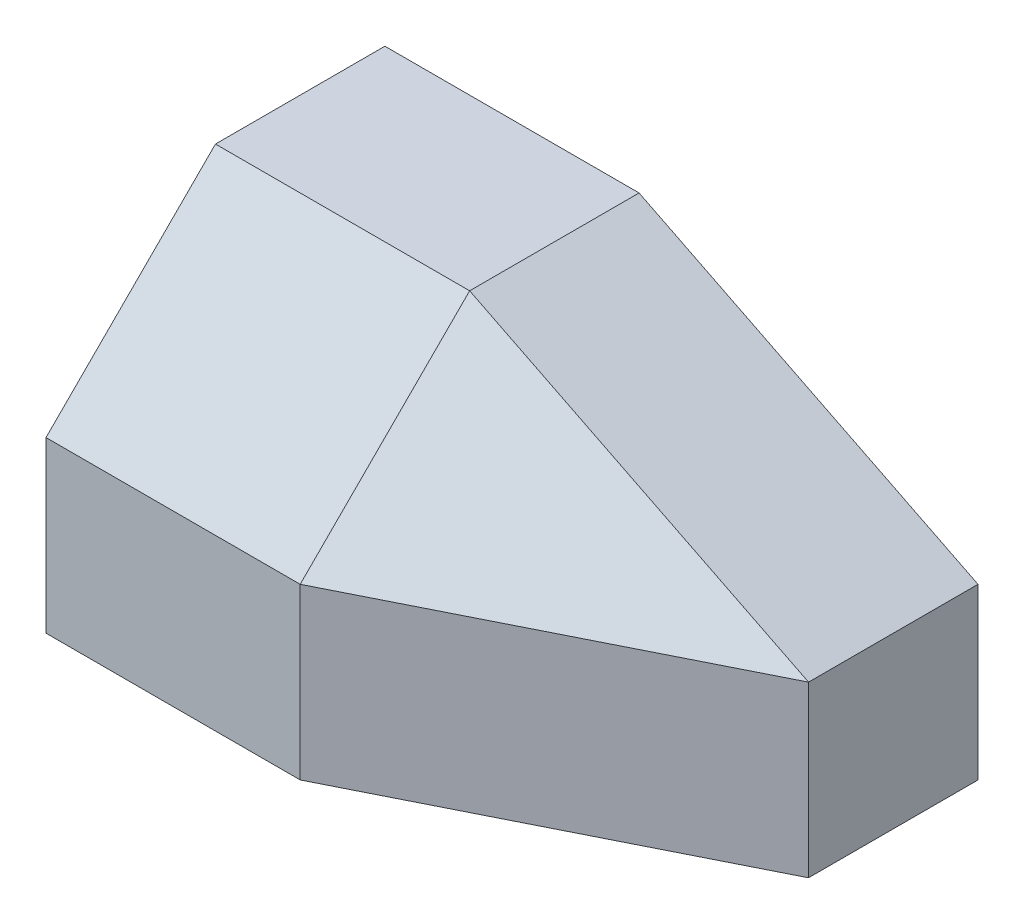
ISO-10303-21;
HEADER;
FILE_DESCRIPTION(('STEP AP214'),'2;1');
FILE_NAME('part.step','',(''),(''),'','','');
FILE_SCHEMA(('AUTOMOTIVE_DESIGN { 1 0 10303 214 1 1 1 1 }'));
ENDSEC;
DATA;
#1=APPLICATION_CONTEXT('core data for automotive mechanical design processes');
#2=APPLICATION_PROTOCOL_DEFINITION('international standard','automotive_design',2000,#1);
#3=PRODUCT_CONTEXT('',#1,'mechanical');
#4=PRODUCT('Part','Part','',(#3));
#5=PRODUCT_RELATED_PRODUCT_CATEGORY('part','',(#4));
#6=PRODUCT_DEFINITION_FORMATION('','',#4);
#7=PRODUCT_DEFINITION_CONTEXT('part definition',#1,'design');
#8=PRODUCT_DEFINITION('design','',#6,#7);
#9=PRODUCT_DEFINITION_SHAPE('','',#8);
#10=(LENGTH_UNIT() NAMED_UNIT(*) SI_UNIT(.MILLI.,.METRE.));
#11=(NAMED_UNIT(*) PLANE_ANGLE_UNIT() SI_UNIT($,.RADIAN.));
#12=(NAMED_UNIT(*) SI_UNIT($,.STERADIAN.) SOLID_ANGLE_UNIT());
#13=UNCERTAINTY_MEASURE_WITH_UNIT(LENGTH_MEASURE(1.E-05),#10,'distance_accuracy_value','');
#14=(GEOMETRIC_REPRESENTATION_CONTEXT(3) GLOBAL_UNCERTAINTY_ASSIGNED_CONTEXT((#13)) GLOBAL_UNIT_ASSIGNED_CONTEXT((#10,
#11,#12)) REPRESENTATION_CONTEXT('',''));
#15=CARTESIAN_POINT('',(0.,0.,0.));
#16=DIRECTION('',(0.,0.,1.));
#17=DIRECTION('',(1.,0.,0.));
#18=AXIS2_PLACEMENT_3D('',#15,#16,#17);
#19=CARTESIAN_POINT('',(762.,1016.,0.));
#20=DIRECTION('',(0.,0.,-1.));
#21=DIRECTION('',(-1.,0.,0.));
#22=AXIS2_PLACEMENT_3D('',#19,#20,#21);
#23=PLANE('',#22);
#24=DIRECTION('',(0.,-1.,0.));
#25=VECTOR('',#24,1.);
#26=CARTESIAN_POINT('',(762.,1016.,0.));
#27=LINE('',#26,#25);
#28=CARTESIAN_POINT('',(761.999999999999,508.,-1.11022302462516E-13));
#29=VERTEX_POINT('',#28);
#30=CARTESIAN_POINT('',(762.,0.,0.));
#31=VERTEX_POINT('',#30);
#32=EDGE_CURVE('E41',#29,#31,#27,.T.);
#33=ORIENTED_EDGE('',*,*,#32,.F.);
#34=DIRECTION('',(-1.,0.,0.));
#35=VECTOR('',#34,1.);
#36=CARTESIAN_POINT('',(1778.,508.,0.));
#37=LINE('',#36,#35);
#38=CARTESIAN_POINT('',(0.,508.,0.));
#39=VERTEX_POINT('',#38);
#40=EDGE_CURVE('E150',#29,#39,#37,.T.);
#41=ORIENTED_EDGE('',*,*,#40,.T.);
#42=DIRECTION('',(0.,-1.,0.));
#43=VECTOR('',#42,1.);
#44=CARTESIAN_POINT('',(0.,1016.,0.));
#45=LINE('',#44,#43);
#46=CARTESIAN_POINT('',(0.,0.,0.));
#47=VERTEX_POINT('',#46);
#48=EDGE_CURVE('E96',#39,#47,#45,.T.);
#49=ORIENTED_EDGE('',*,*,#48,.T.);
#50=DIRECTION('',(1.,0.,0.));
#51=VECTOR('',#50,1.);
#52=CARTESIAN_POINT('',(762.,0.,0.));
#53=LINE('',#52,#51);
#54=EDGE_CURVE('E101',#47,#31,#53,.T.);
#55=ORIENTED_EDGE('',*,*,#54,.T.);
#56=EDGE_LOOP('',(#33,#41,#49,#55));
#57=FACE_BOUND('',#56,.T.);
#58=ADVANCED_FACE('F34',(#57),#23,.F.);
#59=CARTESIAN_POINT('',(1778.,1016.,-508.));
#60=DIRECTION('',(-0.447213595499958,0.,-0.894427190999916));
#61=DIRECTION('',(-0.894427190999916,0.,0.447213595499958));
#62=AXIS2_PLACEMENT_3D('',#59,#60,#61);
#63=PLANE('',#62);
#64=DIRECTION('',(0.,-1.,0.));
#65=VECTOR('',#64,1.);
#66=CARTESIAN_POINT('',(1778.,1016.,-508.));
#67=LINE('',#66,#65);
#68=CARTESIAN_POINT('',(1778.,508.,-508.000000000001));
#69=VERTEX_POINT('',#68);
#70=CARTESIAN_POINT('',(1778.,0.,-508.));
#71=VERTEX_POINT('',#70);
#72=EDGE_CURVE('E108',#69,#71,#67,.T.);
#73=ORIENTED_EDGE('',*,*,#72,.F.);
#74=DIRECTION('',(-0.894427190999916,0.,0.447213595499958));
#75=VECTOR('',#74,1.);
#76=CARTESIAN_POINT('',(1778.,507.999999999999,-508.));
#77=LINE('',#76,#75);
#78=EDGE_CURVE('E118',#69,#29,#77,.T.);
#79=ORIENTED_EDGE('',*,*,#78,.T.);
#80=ORIENTED_EDGE('',*,*,#32,.T.);
#81=DIRECTION('',(0.894427190999916,0.,-0.447213595499958));
#82=VECTOR('',#81,1.);
#83=CARTESIAN_POINT('',(1778.,0.,-508.));
#84=LINE('',#83,#82);
#85=EDGE_CURVE('E115',#31,#71,#84,.T.);
#86=ORIENTED_EDGE('',*,*,#85,.T.);
#87=EDGE_LOOP('',(#73,#79,#80,#86));
#88=FACE_BOUND('',#87,.T.);
#89=ADVANCED_FACE('F114',(#88),#63,.F.);
#90=CARTESIAN_POINT('',(1778.,1016.,-1016.));
#91=DIRECTION('',(-1.,0.,0.));
#92=DIRECTION('',(0.,0.,1.));
#93=AXIS2_PLACEMENT_3D('',#90,#91,#92);
#94=PLANE('',#93);
#95=DIRECTION('',(0.,-1.,0.));
#96=VECTOR('',#95,1.);
#97=CARTESIAN_POINT('',(1778.,1016.,-1016.));
#98=LINE('',#97,#96);
#99=CARTESIAN_POINT('',(1778.,508.,-1016.));
#100=VERTEX_POINT('',#99);
#101=CARTESIAN_POINT('',(1778.,0.,-1016.));
#102=VERTEX_POINT('',#101);
#103=EDGE_CURVE('E81',#100,#102,#98,.T.);
#104=ORIENTED_EDGE('',*,*,#103,.F.);
#105=DIRECTION('',(0.,0.,-1.));
#106=VECTOR('',#105,1.);
#107=CARTESIAN_POINT('',(1778.,508.,0.));
#108=LINE('',#107,#106);
#109=EDGE_CURVE('E124',#69,#100,#108,.T.);
#110=ORIENTED_EDGE('',*,*,#109,.F.);
#111=ORIENTED_EDGE('',*,*,#72,.T.);
#112=DIRECTION('',(0.,0.,-1.));
#113=VECTOR('',#112,1.);
#114=CARTESIAN_POINT('',(1778.,0.,-1016.));
#115=LINE('',#114,#113);
#116=EDGE_CURVE('E87',#71,#102,#115,.T.);
#117=ORIENTED_EDGE('',*,*,#116,.T.);
#118=EDGE_LOOP('',(#104,#110,#111,#117));
#119=FACE_BOUND('',#118,.T.);
#120=ADVANCED_FACE('F128',(#119),#94,.F.);
#121=CARTESIAN_POINT('',(0.,1016.,-1016.));
#122=DIRECTION('',(0.,0.,1.));
#123=DIRECTION('',(1.,0.,0.));
#124=AXIS2_PLACEMENT_3D('',#121,#122,#123);
#125=PLANE('',#124);
#126=DIRECTION('',(-1.,0.,0.));
#127=VECTOR('',#126,1.);
#128=CARTESIAN_POINT('',(0.,1016.,-1016.));
#129=LINE('',#128,#127);
#130=CARTESIAN_POINT('',(762.,1016.,-1016.));
#131=VERTEX_POINT('',#130);
#132=CARTESIAN_POINT('',(0.,1016.,-1016.));
#133=VERTEX_POINT('',#132);
#134=EDGE_CURVE('E54',#131,#133,#129,.T.);
#135=ORIENTED_EDGE('',*,*,#134,.F.);
#136=DIRECTION('',(-0.894427190999916,0.447213595499958,0.));
#137=VECTOR('',#136,1.);
#138=CARTESIAN_POINT('',(762.,1016.,-1016.));
#139=LINE('',#138,#137);
#140=EDGE_CURVE('E148',#100,#131,#139,.T.);
#141=ORIENTED_EDGE('',*,*,#140,.F.);
#142=ORIENTED_EDGE('',*,*,#103,.T.);
#143=DIRECTION('',(-1.,0.,0.));
#144=VECTOR('',#143,1.);
#145=CARTESIAN_POINT('',(0.,0.,-1016.));
#146=LINE('',#145,#144);
#147=CARTESIAN_POINT('',(0.,0.,-1016.));
#148=VERTEX_POINT('',#147);
#149=EDGE_CURVE('E74',#102,#148,#146,.T.);
#150=ORIENTED_EDGE('',*,*,#149,.T.);
#151=DIRECTION('',(0.,-1.,0.));
#152=VECTOR('',#151,1.);
#153=CARTESIAN_POINT('',(0.,1016.,-1016.));
#154=LINE('',#153,#152);
#155=EDGE_CURVE('E77',#133,#148,#154,.T.);
#156=ORIENTED_EDGE('',*,*,#155,.F.);
#157=EDGE_LOOP('',(#135,#141,#142,#150,#156));
#158=FACE_BOUND('',#157,.T.);
#159=ADVANCED_FACE('F76',(#158),#125,.F.);
#160=CARTESIAN_POINT('',(0.,1016.,0.));
#161=DIRECTION('',(1.,0.,0.));
#162=DIRECTION('',(0.,0.,-1.));
#163=AXIS2_PLACEMENT_3D('',#160,#161,#162);
#164=PLANE('',#163);
#165=ORIENTED_EDGE('',*,*,#48,.F.);
#166=DIRECTION('',(0.,-0.707106781186546,0.707106781186549));
#167=VECTOR('',#166,1.);
#168=CARTESIAN_POINT('',(0.,1016.,-508.000000000002));
#169=LINE('',#168,#167);
#170=CARTESIAN_POINT('',(0.,1016.,-508.000000000002));
#171=VERTEX_POINT('',#170);
#172=EDGE_CURVE('E155',#171,#39,#169,.T.);
#173=ORIENTED_EDGE('',*,*,#172,.F.);
#174=DIRECTION('',(0.,0.,1.));
#175=VECTOR('',#174,1.);
#176=CARTESIAN_POINT('',(0.,1016.,0.));
#177=LINE('',#176,#175);
#178=EDGE_CURVE('E95',#133,#171,#177,.T.);
#179=ORIENTED_EDGE('',*,*,#178,.F.);
#180=ORIENTED_EDGE('',*,*,#155,.T.);
#181=DIRECTION('',(0.,0.,1.));
#182=VECTOR('',#181,1.);
#183=CARTESIAN_POINT('',(0.,0.,0.));
#184=LINE('',#183,#182);
#185=EDGE_CURVE('E86',#148,#47,#184,.T.);
#186=ORIENTED_EDGE('',*,*,#185,.T.);
#187=EDGE_LOOP('',(#165,#173,#179,#180,#186));
#188=FACE_BOUND('',#187,.T.);
#189=ADVANCED_FACE('F92',(#188),#164,.F.);
#190=CARTESIAN_POINT('',(0.,1016.,0.));
#191=DIRECTION('',(0.,-1.,0.));
#192=DIRECTION('',(0.,0.,-1.));
#193=AXIS2_PLACEMENT_3D('',#190,#191,#192);
#194=PLANE('',#193);
#195=ORIENTED_EDGE('',*,*,#178,.T.);
#196=DIRECTION('',(-1.,0.,0.));
#197=VECTOR('',#196,1.);
#198=CARTESIAN_POINT('',(1778.,1016.,-508.000000000002));
#199=LINE('',#198,#197);
#200=CARTESIAN_POINT('',(762.,1016.,-508.000000000002));
#201=VERTEX_POINT('',#200);
#202=EDGE_CURVE('E152',#201,#171,#199,.T.);
#203=ORIENTED_EDGE('',*,*,#202,.F.);
#204=DIRECTION('',(0.,0.,-1.));
#205=VECTOR('',#204,1.);
#206=CARTESIAN_POINT('',(762.,1016.,0.));
#207=LINE('',#206,#205);
#208=EDGE_CURVE('E48',#201,#131,#207,.T.);
#209=ORIENTED_EDGE('',*,*,#208,.T.);
#210=ORIENTED_EDGE('',*,*,#134,.T.);
#211=EDGE_LOOP('',(#195,#203,#209,#210));
#212=FACE_BOUND('',#211,.T.);
#213=ADVANCED_FACE('F161',(#212),#194,.F.);
#214=CARTESIAN_POINT('',(0.,0.,0.));
#215=DIRECTION('',(0.,-1.,0.));
#216=DIRECTION('',(0.,0.,-1.));
#217=AXIS2_PLACEMENT_3D('',#214,#215,#216);
#218=PLANE('',#217);
#219=ORIENTED_EDGE('',*,*,#54,.F.);
#220=ORIENTED_EDGE('',*,*,#185,.F.);
#221=ORIENTED_EDGE('',*,*,#149,.F.);
#222=ORIENTED_EDGE('',*,*,#116,.F.);
#223=ORIENTED_EDGE('',*,*,#85,.F.);
#224=EDGE_LOOP('',(#219,#220,#221,#222,#223));
#225=FACE_BOUND('',#224,.T.);
#226=ADVANCED_FACE('F98',(#225),#218,.T.);
#227=CARTESIAN_POINT('',(762.,1016.,0.));
#228=DIRECTION('',(-0.447213595499958,-0.894427190999916,0.));
#229=DIRECTION('',(0.894427190999916,-0.447213595499958,0.));
#230=AXIS2_PLACEMENT_3D('',#227,#228,#229);
#231=PLANE('',#230);
#232=ORIENTED_EDGE('',*,*,#208,.F.);
#233=DIRECTION('',(0.894427190999916,-0.447213595499958,0.));
#234=VECTOR('',#233,1.);
#235=CARTESIAN_POINT('',(762.000000000001,1016.,-508.000000000003));
#236=LINE('',#235,#234);
#237=EDGE_CURVE('E145',#201,#69,#236,.T.);
#238=ORIENTED_EDGE('',*,*,#237,.T.);
#239=ORIENTED_EDGE('',*,*,#109,.T.);
#240=ORIENTED_EDGE('',*,*,#140,.T.);
#241=EDGE_LOOP('',(#232,#238,#239,#240));
#242=FACE_BOUND('',#241,.T.);
#243=ADVANCED_FACE('F147',(#242),#231,.F.);
#244=CARTESIAN_POINT('',(1778.,1016.,-508.000000000002));
#245=DIRECTION('',(0.,-0.707106781186549,-0.707106781186546));
#246=DIRECTION('',(0.,0.707106781186546,-0.707106781186549));
#247=AXIS2_PLACEMENT_3D('',#244,#245,#246);
#248=PLANE('',#247);
#249=ORIENTED_EDGE('',*,*,#40,.F.);
#250=DIRECTION('',(0.,0.707106781186546,-0.707106781186549));
#251=VECTOR('',#250,1.);
#252=CARTESIAN_POINT('',(761.999999999999,1016.,-508.000000000002));
#253=LINE('',#252,#251);
#254=EDGE_CURVE('E12',#29,#201,#253,.T.);
#255=ORIENTED_EDGE('',*,*,#254,.T.);
#256=ORIENTED_EDGE('',*,*,#202,.T.);
#257=ORIENTED_EDGE('',*,*,#172,.T.);
#258=EDGE_LOOP('',(#249,#255,#256,#257));
#259=FACE_BOUND('',#258,.T.);
#260=ADVANCED_FACE('F160',(#259),#248,.F.);
#261=CARTESIAN_POINT('',(197.555555555555,395.111111111112,395.111111111111));
#262=DIRECTION('',(-0.333333333333333,-0.666666666666669,-0.666666666666665));
#263=DIRECTION('',(0.,0.707106781186546,-0.707106781186549));
#264=AXIS2_PLACEMENT_3D('',#261,#262,#263);
#265=PLANE('',#264);
#266=ORIENTED_EDGE('',*,*,#78,.F.);
#267=ORIENTED_EDGE('',*,*,#237,.F.);
#268=ORIENTED_EDGE('',*,*,#254,.F.);
#269=EDGE_LOOP('',(#266,#267,#268));
#270=FACE_BOUND('',#269,.T.);
#271=ADVANCED_FACE('F212',(#270),#265,.F.);
#272=CLOSED_SHELL('',(#58,#89,#120,#159,#189,#213,#226,#243,#260,#271));
#273=MANIFOLD_SOLID_BREP('B2',#272);
#274=ADVANCED_BREP_SHAPE_REPRESENTATION('',(#18,#273),#14);
#275=SHAPE_DEFINITION_REPRESENTATION(#9,#274);
ENDSEC;
END-ISO-10303-21;
